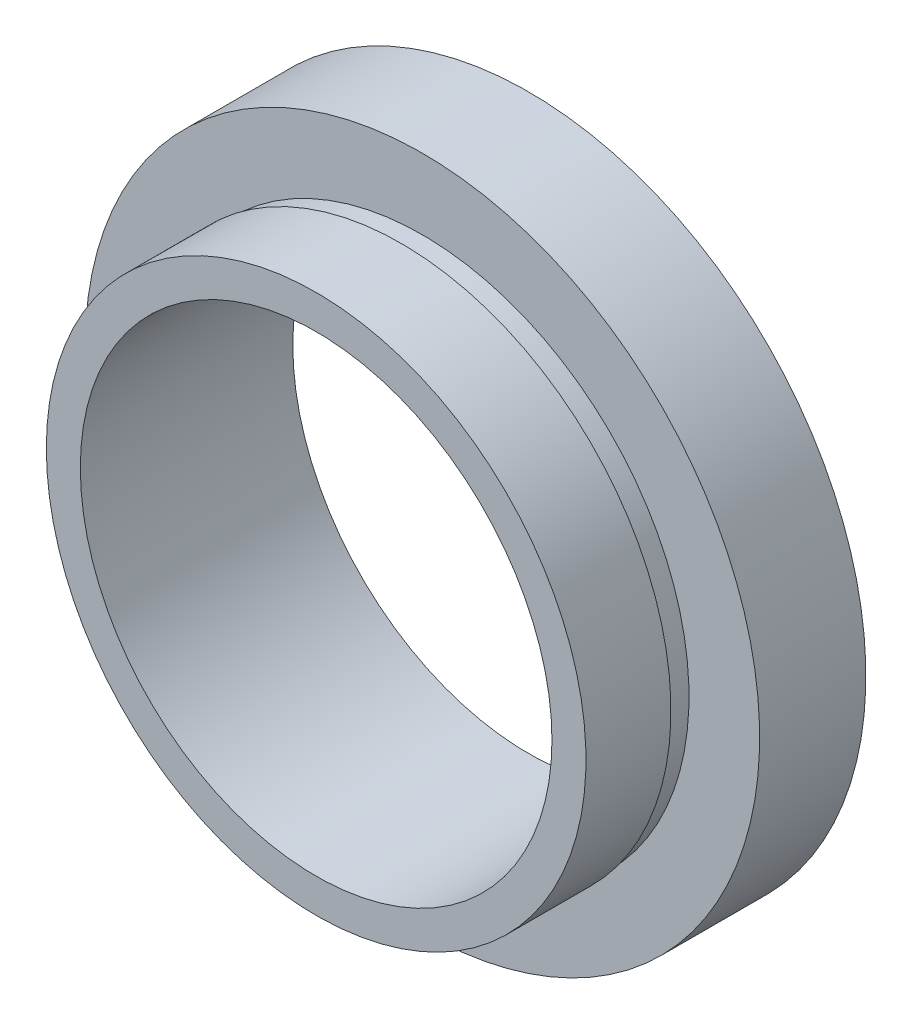
ISO-10303-21;
HEADER;
FILE_DESCRIPTION(('STEP AP214'),'2;1');
FILE_NAME('part.step','',(''),(''),'','','');
FILE_SCHEMA(('AUTOMOTIVE_DESIGN { 1 0 10303 214 1 1 1 1 }'));
ENDSEC;
DATA;
#1=APPLICATION_CONTEXT('core data for automotive mechanical design processes');
#2=APPLICATION_PROTOCOL_DEFINITION('international standard','automotive_design',2000,#1);
#3=PRODUCT_CONTEXT('',#1,'mechanical');
#4=PRODUCT('Part','Part','',(#3));
#5=PRODUCT_RELATED_PRODUCT_CATEGORY('part','',(#4));
#6=PRODUCT_DEFINITION_FORMATION('','',#4);
#7=PRODUCT_DEFINITION_CONTEXT('part definition',#1,'design');
#8=PRODUCT_DEFINITION('design','',#6,#7);
#9=PRODUCT_DEFINITION_SHAPE('','',#8);
#10=(LENGTH_UNIT() NAMED_UNIT(*) SI_UNIT(.MILLI.,.METRE.));
#11=(NAMED_UNIT(*) PLANE_ANGLE_UNIT() SI_UNIT($,.RADIAN.));
#12=(NAMED_UNIT(*) SI_UNIT($,.STERADIAN.) SOLID_ANGLE_UNIT());
#13=UNCERTAINTY_MEASURE_WITH_UNIT(LENGTH_MEASURE(1.E-05),#10,'distance_accuracy_value','');
#14=(GEOMETRIC_REPRESENTATION_CONTEXT(3) GLOBAL_UNCERTAINTY_ASSIGNED_CONTEXT((#13)) GLOBAL_UNIT_ASSIGNED_CONTEXT((#10,
#11,#12)) REPRESENTATION_CONTEXT('',''));
#15=CARTESIAN_POINT('',(0.,0.,0.));
#16=DIRECTION('',(0.,0.,1.));
#17=DIRECTION('',(1.,0.,0.));
#18=AXIS2_PLACEMENT_3D('',#15,#16,#17);
#19=CARTESIAN_POINT('',(11.1,0.,0.));
#20=DIRECTION('',(0.,0.,-1.));
#21=DIRECTION('',(-1.,0.,0.));
#22=AXIS2_PLACEMENT_3D('',#19,#20,#21);
#23=PLANE('',#22);
#24=CARTESIAN_POINT('',(0.,0.,0.));
#25=DIRECTION('',(0.,0.,-1.));
#26=DIRECTION('',(-1.,0.,0.));
#27=AXIS2_PLACEMENT_3D('',#24,#25,#26);
#28=CIRCLE('',#27,12.7);
#29=CARTESIAN_POINT('',(-12.7,0.,0.));
#30=VERTEX_POINT('',#29);
#31=EDGE_CURVE('E10',#30,#30,#28,.T.);
#32=ORIENTED_EDGE('',*,*,#31,.F.);
#33=EDGE_LOOP('',(#32));
#34=FACE_BOUND('',#33,.T.);
#35=CARTESIAN_POINT('',(0.,0.,0.));
#36=DIRECTION('',(0.,0.,-1.));
#37=DIRECTION('',(-1.,0.,0.));
#38=AXIS2_PLACEMENT_3D('',#35,#36,#37);
#39=CIRCLE('',#38,11.1);
#40=CARTESIAN_POINT('',(-11.1,0.,0.));
#41=VERTEX_POINT('',#40);
#42=EDGE_CURVE('E63',#41,#41,#39,.T.);
#43=ORIENTED_EDGE('',*,*,#42,.T.);
#44=EDGE_LOOP('',(#43));
#45=FACE_BOUND('',#44,.T.);
#46=ADVANCED_FACE('F35',(#34,#45),#23,.F.);
#47=CARTESIAN_POINT('',(0.,0.,-19.1405797101449));
#48=DIRECTION('',(0.,0.,-1.));
#49=DIRECTION('',(-1.,0.,0.));
#50=AXIS2_PLACEMENT_3D('',#47,#48,#49);
#51=CYLINDRICAL_SURFACE('',#50,12.7);
#52=CARTESIAN_POINT('',(0.,0.,-4.));
#53=DIRECTION('',(0.,0.,-1.));
#54=DIRECTION('',(-1.,0.,0.));
#55=AXIS2_PLACEMENT_3D('',#52,#53,#54);
#56=CIRCLE('',#55,12.7);
#57=CARTESIAN_POINT('',(-12.7,0.,-4.));
#58=VERTEX_POINT('',#57);
#59=EDGE_CURVE('E41',#58,#58,#56,.T.);
#60=ORIENTED_EDGE('',*,*,#59,.F.);
#61=EDGE_LOOP('',(#60));
#62=FACE_BOUND('',#61,.T.);
#63=ORIENTED_EDGE('',*,*,#31,.T.);
#64=EDGE_LOOP('',(#63));
#65=FACE_BOUND('',#64,.T.);
#66=ADVANCED_FACE('F100',(#62,#65),#51,.T.);
#67=CARTESIAN_POINT('',(12.7,0.,-4.));
#68=DIRECTION('',(0.,0.,1.));
#69=DIRECTION('',(1.,0.,0.));
#70=AXIS2_PLACEMENT_3D('',#67,#68,#69);
#71=PLANE('',#70);
#72=CARTESIAN_POINT('',(0.,0.,-4.));
#73=DIRECTION('',(0.,0.,-1.));
#74=DIRECTION('',(-1.,0.,0.));
#75=AXIS2_PLACEMENT_3D('',#72,#73,#74);
#76=CIRCLE('',#75,12.55);
#77=CARTESIAN_POINT('',(-12.55,0.,-4.));
#78=VERTEX_POINT('',#77);
#79=EDGE_CURVE('E45',#78,#78,#76,.T.);
#80=ORIENTED_EDGE('',*,*,#79,.F.);
#81=EDGE_LOOP('',(#80));
#82=FACE_BOUND('',#81,.T.);
#83=ORIENTED_EDGE('',*,*,#59,.T.);
#84=EDGE_LOOP('',(#83));
#85=FACE_BOUND('',#84,.T.);
#86=ADVANCED_FACE('F95',(#82,#85),#71,.F.);
#87=CARTESIAN_POINT('',(0.,0.,-19.1405797101449));
#88=DIRECTION('',(0.,0.,-1.));
#89=DIRECTION('',(-1.,0.,0.));
#90=AXIS2_PLACEMENT_3D('',#87,#88,#89);
#91=CYLINDRICAL_SURFACE('',#90,12.55);
#92=CARTESIAN_POINT('',(0.,0.,-5.));
#93=DIRECTION('',(0.,0.,-1.));
#94=DIRECTION('',(-1.,0.,0.));
#95=AXIS2_PLACEMENT_3D('',#92,#93,#94);
#96=CIRCLE('',#95,12.55);
#97=CARTESIAN_POINT('',(-12.55,0.,-5.));
#98=VERTEX_POINT('',#97);
#99=EDGE_CURVE('E49',#98,#98,#96,.T.);
#100=ORIENTED_EDGE('',*,*,#99,.F.);
#101=EDGE_LOOP('',(#100));
#102=FACE_BOUND('',#101,.T.);
#103=ORIENTED_EDGE('',*,*,#79,.T.);
#104=EDGE_LOOP('',(#103));
#105=FACE_BOUND('',#104,.T.);
#106=ADVANCED_FACE('F89',(#102,#105),#91,.T.);
#107=CARTESIAN_POINT('',(12.55,0.,-5.));
#108=DIRECTION('',(0.,0.,-1.));
#109=DIRECTION('',(-1.,0.,0.));
#110=AXIS2_PLACEMENT_3D('',#107,#108,#109);
#111=PLANE('',#110);
#112=CARTESIAN_POINT('',(0.,0.,-5.));
#113=DIRECTION('',(0.,0.,-1.));
#114=DIRECTION('',(-1.,0.,0.));
#115=AXIS2_PLACEMENT_3D('',#112,#113,#114);
#116=CIRCLE('',#115,15.875);
#117=CARTESIAN_POINT('',(-15.875,0.,-5.));
#118=VERTEX_POINT('',#117);
#119=EDGE_CURVE('E54',#118,#118,#116,.T.);
#120=ORIENTED_EDGE('',*,*,#119,.F.);
#121=EDGE_LOOP('',(#120));
#122=FACE_BOUND('',#121,.T.);
#123=ORIENTED_EDGE('',*,*,#99,.T.);
#124=EDGE_LOOP('',(#123));
#125=FACE_BOUND('',#124,.T.);
#126=ADVANCED_FACE('F83',(#122,#125),#111,.F.);
#127=CARTESIAN_POINT('',(0.,0.,-19.1405797101449));
#128=DIRECTION('',(0.,0.,-1.));
#129=DIRECTION('',(-1.,0.,0.));
#130=AXIS2_PLACEMENT_3D('',#127,#128,#129);
#131=CYLINDRICAL_SURFACE('',#130,15.875);
#132=CARTESIAN_POINT('',(0.,0.,-10.));
#133=DIRECTION('',(0.,0.,-1.));
#134=DIRECTION('',(-1.,0.,0.));
#135=AXIS2_PLACEMENT_3D('',#132,#133,#134);
#136=CIRCLE('',#135,15.875);
#137=CARTESIAN_POINT('',(-15.875,0.,-10.));
#138=VERTEX_POINT('',#137);
#139=EDGE_CURVE('E57',#138,#138,#136,.T.);
#140=ORIENTED_EDGE('',*,*,#139,.F.);
#141=EDGE_LOOP('',(#140));
#142=FACE_BOUND('',#141,.T.);
#143=ORIENTED_EDGE('',*,*,#119,.T.);
#144=EDGE_LOOP('',(#143));
#145=FACE_BOUND('',#144,.T.);
#146=ADVANCED_FACE('F77',(#142,#145),#131,.T.);
#147=CARTESIAN_POINT('',(15.875,0.,-10.));
#148=DIRECTION('',(0.,0.,1.));
#149=DIRECTION('',(1.,0.,0.));
#150=AXIS2_PLACEMENT_3D('',#147,#148,#149);
#151=PLANE('',#150);
#152=CARTESIAN_POINT('',(0.,0.,-10.));
#153=DIRECTION('',(0.,0.,-1.));
#154=DIRECTION('',(-1.,0.,0.));
#155=AXIS2_PLACEMENT_3D('',#152,#153,#154);
#156=CIRCLE('',#155,11.1);
#157=CARTESIAN_POINT('',(-11.1,0.,-10.));
#158=VERTEX_POINT('',#157);
#159=EDGE_CURVE('E60',#158,#158,#156,.T.);
#160=ORIENTED_EDGE('',*,*,#159,.F.);
#161=EDGE_LOOP('',(#160));
#162=FACE_BOUND('',#161,.T.);
#163=ORIENTED_EDGE('',*,*,#139,.T.);
#164=EDGE_LOOP('',(#163));
#165=FACE_BOUND('',#164,.T.);
#166=ADVANCED_FACE('F71',(#162,#165),#151,.F.);
#167=CARTESIAN_POINT('',(0.,0.,-19.1405797101449));
#168=DIRECTION('',(0.,0.,-1.));
#169=DIRECTION('',(-1.,0.,0.));
#170=AXIS2_PLACEMENT_3D('',#167,#168,#169);
#171=CYLINDRICAL_SURFACE('',#170,11.1);
#172=ORIENTED_EDGE('',*,*,#42,.F.);
#173=EDGE_LOOP('',(#172));
#174=FACE_BOUND('',#173,.T.);
#175=ORIENTED_EDGE('',*,*,#159,.T.);
#176=EDGE_LOOP('',(#175));
#177=FACE_BOUND('',#176,.T.);
#178=ADVANCED_FACE('F68',(#174,#177),#171,.F.);
#179=CLOSED_SHELL('',(#46,#66,#86,#106,#126,#146,#166,#178));
#180=MANIFOLD_SOLID_BREP('B2',#179);
#181=ADVANCED_BREP_SHAPE_REPRESENTATION('',(#18,#180),#14);
#182=SHAPE_DEFINITION_REPRESENTATION(#9,#181);
ENDSEC;
END-ISO-10303-21;
